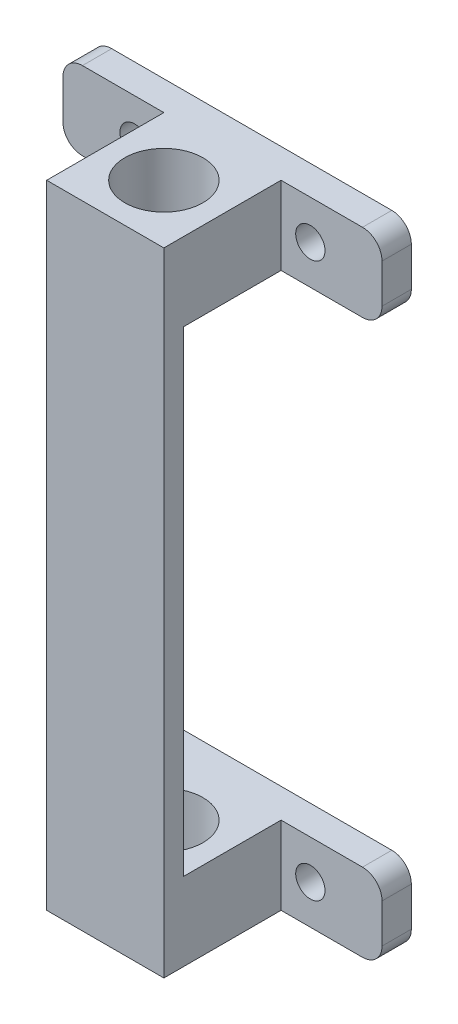
ISO-10303-21;
HEADER;
FILE_DESCRIPTION(('STEP AP214'),'2;1');
FILE_NAME('part.step','',(''),(''),'','','');
FILE_SCHEMA(('AUTOMOTIVE_DESIGN { 1 0 10303 214 1 1 1 1 }'));
ENDSEC;
DATA;
#1=APPLICATION_CONTEXT('core data for automotive mechanical design processes');
#2=APPLICATION_PROTOCOL_DEFINITION('international standard','automotive_design',2000,#1);
#3=PRODUCT_CONTEXT('',#1,'mechanical');
#4=PRODUCT('Part','Part','',(#3));
#5=PRODUCT_RELATED_PRODUCT_CATEGORY('part','',(#4));
#6=PRODUCT_DEFINITION_FORMATION('','',#4);
#7=PRODUCT_DEFINITION_CONTEXT('part definition',#1,'design');
#8=PRODUCT_DEFINITION('design','',#6,#7);
#9=PRODUCT_DEFINITION_SHAPE('','',#8);
#10=(LENGTH_UNIT() NAMED_UNIT(*) SI_UNIT(.MILLI.,.METRE.));
#11=(NAMED_UNIT(*) PLANE_ANGLE_UNIT() SI_UNIT($,.RADIAN.));
#12=(NAMED_UNIT(*) SI_UNIT($,.STERADIAN.) SOLID_ANGLE_UNIT());
#13=UNCERTAINTY_MEASURE_WITH_UNIT(LENGTH_MEASURE(1.E-05),#10,'distance_accuracy_value','');
#14=(GEOMETRIC_REPRESENTATION_CONTEXT(3) GLOBAL_UNCERTAINTY_ASSIGNED_CONTEXT((#13)) GLOBAL_UNIT_ASSIGNED_CONTEXT((#10,
#11,#12)) REPRESENTATION_CONTEXT('',''));
#15=CARTESIAN_POINT('',(0.,0.,0.));
#16=DIRECTION('',(0.,0.,1.));
#17=DIRECTION('',(1.,0.,0.));
#18=AXIS2_PLACEMENT_3D('',#15,#16,#17);
#19=CARTESIAN_POINT('',(-20.0653915042754,22.358574689139,-3.));
#20=DIRECTION('',(0.,-1.,0.));
#21=DIRECTION('',(0.,0.,-1.));
#22=AXIS2_PLACEMENT_3D('',#19,#20,#21);
#23=PLANE('',#22);
#24=DIRECTION('',(1.,0.,0.));
#25=VECTOR('',#24,1.);
#26=CARTESIAN_POINT('',(-20.0653915042754,22.358574689139,-3.));
#27=LINE('',#26,#25);
#28=CARTESIAN_POINT('',(-18.0653915042754,22.358574689139,-3.));
#29=VERTEX_POINT('',#28);
#30=CARTESIAN_POINT('',(10.6119967977161,22.358574689139,-3.));
#31=VERTEX_POINT('',#30);
#32=EDGE_CURVE('E416',#29,#31,#27,.T.);
#33=ORIENTED_EDGE('',*,*,#32,.T.);
#34=DIRECTION('',(0.,0.,1.));
#35=VECTOR('',#34,1.);
#36=CARTESIAN_POINT('',(10.6119967977161,22.358574689139,-3.));
#37=LINE('',#36,#35);
#38=CARTESIAN_POINT('',(10.6119967977161,22.358574689139,0.));
#39=VERTEX_POINT('',#38);
#40=EDGE_CURVE('E430',#31,#39,#37,.T.);
#41=ORIENTED_EDGE('',*,*,#40,.T.);
#42=DIRECTION('',(1.,0.,0.));
#43=VECTOR('',#42,1.);
#44=CARTESIAN_POINT('',(-20.0653915042754,22.358574689139,0.));
#45=LINE('',#44,#43);
#46=CARTESIAN_POINT('',(2.27330264672038,22.358574689139,0.));
#47=VERTEX_POINT('',#46);
#48=EDGE_CURVE('E427',#47,#39,#45,.T.);
#49=ORIENTED_EDGE('',*,*,#48,.F.);
#50=DIRECTION('',(0.,0.,-1.));
#51=VECTOR('',#50,1.);
#52=CARTESIAN_POINT('',(2.27330264672038,22.358574689139,6.));
#53=LINE('',#52,#51);
#54=CARTESIAN_POINT('',(2.27330264672038,22.358574689139,10.));
#55=VERTEX_POINT('',#54);
#56=EDGE_CURVE('E386',#55,#47,#53,.T.);
#57=ORIENTED_EDGE('',*,*,#56,.F.);
#58=DIRECTION('',(-1.,0.,0.));
#59=VECTOR('',#58,1.);
#60=CARTESIAN_POINT('',(-9.72669735327963,22.358574689139,10.));
#61=LINE('',#60,#59);
#62=CARTESIAN_POINT('',(-3.72669735327962,22.358574689139,10.));
#63=VERTEX_POINT('',#62);
#64=EDGE_CURVE('E243',#55,#63,#61,.T.);
#65=ORIENTED_EDGE('',*,*,#64,.T.);
#66=CARTESIAN_POINT('',(-3.72669735327962,22.358574689139,6.));
#67=DIRECTION('',(0.,-1.,0.));
#68=DIRECTION('',(0.,0.,-1.));
#69=AXIS2_PLACEMENT_3D('',#66,#67,#68);
#70=CIRCLE('',#69,4.);
#71=EDGE_CURVE('E362',#63,#63,#70,.T.);
#72=ORIENTED_EDGE('',*,*,#71,.F.);
#73=CARTESIAN_POINT('',(-9.72669735327963,22.358574689139,10.));
#74=VERTEX_POINT('',#73);
#75=EDGE_CURVE('E246',#63,#74,#61,.T.);
#76=ORIENTED_EDGE('',*,*,#75,.T.);
#77=DIRECTION('',(0.,0.,-1.));
#78=VECTOR('',#77,1.);
#79=CARTESIAN_POINT('',(-9.72669735327963,22.358574689139,6.));
#80=LINE('',#79,#78);
#81=CARTESIAN_POINT('',(-9.72669735327963,22.358574689139,0.));
#82=VERTEX_POINT('',#81);
#83=EDGE_CURVE('E382',#74,#82,#80,.T.);
#84=ORIENTED_EDGE('',*,*,#83,.T.);
#85=CARTESIAN_POINT('',(-18.0653915042754,22.358574689139,0.));
#86=VERTEX_POINT('',#85);
#87=EDGE_CURVE('E410',#86,#82,#45,.T.);
#88=ORIENTED_EDGE('',*,*,#87,.F.);
#89=DIRECTION('',(0.,0.,1.));
#90=VECTOR('',#89,1.);
#91=CARTESIAN_POINT('',(-18.0653915042754,22.358574689139,-3.));
#92=LINE('',#91,#90);
#93=EDGE_CURVE('E419',#86,#29,#92,.F.);
#94=ORIENTED_EDGE('',*,*,#93,.T.);
#95=EDGE_LOOP('',(#33,#41,#49,#57,#65,#72,#76,#84,#88,#94));
#96=FACE_BOUND('',#95,.T.);
#97=ADVANCED_FACE('F69',(#96),#23,.T.);
#98=CARTESIAN_POINT('',(0.,0.,0.));
#99=DIRECTION('',(0.,0.,1.));
#100=DIRECTION('',(1.,0.,0.));
#101=AXIS2_PLACEMENT_3D('',#98,#99,#100);
#102=PLANE('',#101);
#103=CARTESIAN_POINT('',(5.27330264672038,26.358574689139,0.));
#104=DIRECTION('',(0.,0.,1.));
#105=DIRECTION('',(1.,0.,0.));
#106=AXIS2_PLACEMENT_3D('',#103,#104,#105);
#107=CIRCLE('',#106,1.5);
#108=CARTESIAN_POINT('',(6.77330264672038,26.358574689139,0.));
#109=VERTEX_POINT('',#108);
#110=EDGE_CURVE('E391',#109,#109,#107,.T.);
#111=ORIENTED_EDGE('',*,*,#110,.F.);
#112=EDGE_LOOP('',(#111));
#113=FACE_BOUND('',#112,.T.);
#114=ORIENTED_EDGE('',*,*,#48,.T.);
#115=CARTESIAN_POINT('',(10.6119967977161,24.358574689139,0.));
#116=DIRECTION('',(0.,0.,1.));
#117=DIRECTION('',(1.,0.,0.));
#118=AXIS2_PLACEMENT_3D('',#115,#116,#117);
#119=CIRCLE('',#118,2.);
#120=CARTESIAN_POINT('',(12.6119967977161,24.358574689139,0.));
#121=VERTEX_POINT('',#120);
#122=EDGE_CURVE('E435',#39,#121,#119,.T.);
#123=ORIENTED_EDGE('',*,*,#122,.T.);
#124=DIRECTION('',(0.,1.,0.));
#125=VECTOR('',#124,1.);
#126=CARTESIAN_POINT('',(12.6119967977161,30.358574689139,0.));
#127=LINE('',#126,#125);
#128=CARTESIAN_POINT('',(12.6119967977161,28.358574689139,0.));
#129=VERTEX_POINT('',#128);
#130=EDGE_CURVE('E397',#121,#129,#127,.T.);
#131=ORIENTED_EDGE('',*,*,#130,.T.);
#132=CARTESIAN_POINT('',(10.6119967977161,28.358574689139,0.));
#133=DIRECTION('',(0.,0.,1.));
#134=DIRECTION('',(1.,0.,0.));
#135=AXIS2_PLACEMENT_3D('',#132,#133,#134);
#136=CIRCLE('',#135,2.);
#137=CARTESIAN_POINT('',(10.6119967977161,30.358574689139,0.));
#138=VERTEX_POINT('',#137);
#139=EDGE_CURVE('E433',#129,#138,#136,.T.);
#140=ORIENTED_EDGE('',*,*,#139,.T.);
#141=DIRECTION('',(-1.,0.,0.));
#142=VECTOR('',#141,1.);
#143=CARTESIAN_POINT('',(-20.0653915042754,30.358574689139,0.));
#144=LINE('',#143,#142);
#145=CARTESIAN_POINT('',(2.27330264672038,30.358574689139,0.));
#146=VERTEX_POINT('',#145);
#147=EDGE_CURVE('E423',#138,#146,#144,.T.);
#148=ORIENTED_EDGE('',*,*,#147,.T.);
#149=DIRECTION('',(0.,-1.,0.));
#150=VECTOR('',#149,1.);
#151=CARTESIAN_POINT('',(2.27330264672038,38.8438560633776,0.));
#152=LINE('',#151,#150);
#153=EDGE_CURVE('E385',#146,#47,#152,.T.);
#154=ORIENTED_EDGE('',*,*,#153,.T.);
#155=EDGE_LOOP('',(#114,#123,#131,#140,#148,#154));
#156=FACE_BOUND('',#155,.T.);
#157=ADVANCED_FACE('F483',(#113,#156),#102,.T.);
#158=CARTESIAN_POINT('',(12.6119967977161,30.358574689139,-3.));
#159=DIRECTION('',(1.,0.,0.));
#160=DIRECTION('',(0.,1.,0.));
#161=AXIS2_PLACEMENT_3D('',#158,#159,#160);
#162=PLANE('',#161);
#163=ORIENTED_EDGE('',*,*,#130,.F.);
#164=DIRECTION('',(0.,0.,1.));
#165=VECTOR('',#164,1.);
#166=CARTESIAN_POINT('',(12.6119967977161,24.358574689139,-3.));
#167=LINE('',#166,#165);
#168=CARTESIAN_POINT('',(12.6119967977161,24.358574689139,-3.));
#169=VERTEX_POINT('',#168);
#170=EDGE_CURVE('E440',#121,#169,#167,.F.);
#171=ORIENTED_EDGE('',*,*,#170,.T.);
#172=DIRECTION('',(0.,1.,0.));
#173=VECTOR('',#172,1.);
#174=CARTESIAN_POINT('',(12.6119967977161,30.358574689139,-3.));
#175=LINE('',#174,#173);
#176=CARTESIAN_POINT('',(12.6119967977161,28.358574689139,-3.));
#177=VERTEX_POINT('',#176);
#178=EDGE_CURVE('E406',#169,#177,#175,.T.);
#179=ORIENTED_EDGE('',*,*,#178,.T.);
#180=DIRECTION('',(0.,0.,1.));
#181=VECTOR('',#180,1.);
#182=CARTESIAN_POINT('',(12.6119967977161,28.358574689139,-3.));
#183=LINE('',#182,#181);
#184=EDGE_CURVE('E437',#177,#129,#183,.T.);
#185=ORIENTED_EDGE('',*,*,#184,.T.);
#186=EDGE_LOOP('',(#163,#171,#179,#185));
#187=FACE_BOUND('',#186,.T.);
#188=ADVANCED_FACE('F485',(#187),#162,.T.);
#189=CARTESIAN_POINT('',(-20.0653915042754,30.358574689139,-3.));
#190=DIRECTION('',(-1.,0.,0.));
#191=DIRECTION('',(0.,0.,1.));
#192=AXIS2_PLACEMENT_3D('',#189,#190,#191);
#193=PLANE('',#192);
#194=DIRECTION('',(0.,-1.,0.));
#195=VECTOR('',#194,1.);
#196=CARTESIAN_POINT('',(-20.0653915042754,30.358574689139,-3.));
#197=LINE('',#196,#195);
#198=CARTESIAN_POINT('',(-20.0653915042754,28.358574689139,-3.));
#199=VERTEX_POINT('',#198);
#200=CARTESIAN_POINT('',(-20.0653915042754,24.358574689139,-3.));
#201=VERTEX_POINT('',#200);
#202=EDGE_CURVE('E413',#199,#201,#197,.T.);
#203=ORIENTED_EDGE('',*,*,#202,.T.);
#204=DIRECTION('',(0.,0.,1.));
#205=VECTOR('',#204,1.);
#206=CARTESIAN_POINT('',(-20.0653915042754,24.358574689139,-3.));
#207=LINE('',#206,#205);
#208=CARTESIAN_POINT('',(-20.0653915042754,24.358574689139,0.));
#209=VERTEX_POINT('',#208);
#210=EDGE_CURVE('E457',#201,#209,#207,.T.);
#211=ORIENTED_EDGE('',*,*,#210,.T.);
#212=DIRECTION('',(0.,-1.,0.));
#213=VECTOR('',#212,1.);
#214=CARTESIAN_POINT('',(-20.0653915042754,30.358574689139,0.));
#215=LINE('',#214,#213);
#216=CARTESIAN_POINT('',(-20.0653915042754,28.358574689139,0.));
#217=VERTEX_POINT('',#216);
#218=EDGE_CURVE('E425',#217,#209,#215,.T.);
#219=ORIENTED_EDGE('',*,*,#218,.F.);
#220=DIRECTION('',(0.,0.,1.));
#221=VECTOR('',#220,1.);
#222=CARTESIAN_POINT('',(-20.0653915042754,28.358574689139,-3.));
#223=LINE('',#222,#221);
#224=EDGE_CURVE('E455',#217,#199,#223,.F.);
#225=ORIENTED_EDGE('',*,*,#224,.T.);
#226=EDGE_LOOP('',(#203,#211,#219,#225));
#227=FACE_BOUND('',#226,.T.);
#228=ADVANCED_FACE('F459',(#227),#193,.T.);
#229=CARTESIAN_POINT('',(-20.0653915042754,30.358574689139,-3.));
#230=DIRECTION('',(0.,1.,0.));
#231=DIRECTION('',(-1.,0.,0.));
#232=AXIS2_PLACEMENT_3D('',#229,#230,#231);
#233=PLANE('',#232);
#234=CARTESIAN_POINT('',(-3.72669735327962,30.358574689139,6.));
#235=DIRECTION('',(0.,-1.,0.));
#236=DIRECTION('',(0.,0.,-1.));
#237=AXIS2_PLACEMENT_3D('',#234,#235,#236);
#238=CIRCLE('',#237,4.);
#239=CARTESIAN_POINT('',(-3.72669735327962,30.358574689139,2.));
#240=VERTEX_POINT('',#239);
#241=EDGE_CURVE('E247',#240,#240,#238,.T.);
#242=ORIENTED_EDGE('',*,*,#241,.T.);
#243=EDGE_LOOP('',(#242));
#244=FACE_BOUND('',#243,.T.);
#245=ORIENTED_EDGE('',*,*,#147,.F.);
#246=DIRECTION('',(0.,0.,1.));
#247=VECTOR('',#246,1.);
#248=CARTESIAN_POINT('',(10.6119967977161,30.358574689139,-3.));
#249=LINE('',#248,#247);
#250=CARTESIAN_POINT('',(10.6119967977161,30.358574689139,-3.));
#251=VERTEX_POINT('',#250);
#252=EDGE_CURVE('E453',#138,#251,#249,.F.);
#253=ORIENTED_EDGE('',*,*,#252,.T.);
#254=DIRECTION('',(-1.,0.,0.));
#255=VECTOR('',#254,1.);
#256=CARTESIAN_POINT('',(-20.0653915042754,30.358574689139,-3.));
#257=LINE('',#256,#255);
#258=CARTESIAN_POINT('',(-18.0653915042754,30.358574689139,-3.));
#259=VERTEX_POINT('',#258);
#260=EDGE_CURVE('E409',#251,#259,#257,.T.);
#261=ORIENTED_EDGE('',*,*,#260,.T.);
#262=DIRECTION('',(0.,0.,1.));
#263=VECTOR('',#262,1.);
#264=CARTESIAN_POINT('',(-18.0653915042754,30.358574689139,-3.));
#265=LINE('',#264,#263);
#266=CARTESIAN_POINT('',(-18.0653915042754,30.358574689139,0.));
#267=VERTEX_POINT('',#266);
#268=EDGE_CURVE('E450',#259,#267,#265,.T.);
#269=ORIENTED_EDGE('',*,*,#268,.T.);
#270=CARTESIAN_POINT('',(-9.72669735327963,30.358574689139,0.));
#271=VERTEX_POINT('',#270);
#272=EDGE_CURVE('E422',#271,#267,#144,.T.);
#273=ORIENTED_EDGE('',*,*,#272,.F.);
#274=DIRECTION('',(0.,0.,-1.));
#275=VECTOR('',#274,1.);
#276=CARTESIAN_POINT('',(-9.72669735327963,30.358574689139,6.));
#277=LINE('',#276,#275);
#278=CARTESIAN_POINT('',(-9.72669735327963,30.358574689139,12.));
#279=VERTEX_POINT('',#278);
#280=EDGE_CURVE('E379',#279,#271,#277,.T.);
#281=ORIENTED_EDGE('',*,*,#280,.F.);
#282=DIRECTION('',(1.,0.,0.));
#283=VECTOR('',#282,1.);
#284=CARTESIAN_POINT('',(-9.72669735327962,30.358574689139,12.));
#285=LINE('',#284,#283);
#286=CARTESIAN_POINT('',(2.27330264672038,30.358574689139,12.));
#287=VERTEX_POINT('',#286);
#288=EDGE_CURVE('E372',#279,#287,#285,.T.);
#289=ORIENTED_EDGE('',*,*,#288,.T.);
#290=DIRECTION('',(0.,0.,-1.));
#291=VECTOR('',#290,1.);
#292=CARTESIAN_POINT('',(2.27330264672038,30.358574689139,6.));
#293=LINE('',#292,#291);
#294=EDGE_CURVE('E388',#287,#146,#293,.T.);
#295=ORIENTED_EDGE('',*,*,#294,.T.);
#296=EDGE_LOOP('',(#245,#253,#261,#269,#273,#281,#289,#295));
#297=FACE_BOUND('',#296,.T.);
#298=ADVANCED_FACE('F494',(#244,#297),#233,.T.);
#299=CARTESIAN_POINT('',(0.,0.,-3.));
#300=DIRECTION('',(0.,0.,1.));
#301=DIRECTION('',(1.,0.,0.));
#302=AXIS2_PLACEMENT_3D('',#299,#300,#301);
#303=PLANE('',#302);
#304=CARTESIAN_POINT('',(-12.7266973532796,26.358574689139,-3.));
#305=DIRECTION('',(0.,0.,1.));
#306=DIRECTION('',(1.,0.,0.));
#307=AXIS2_PLACEMENT_3D('',#304,#305,#306);
#308=CIRCLE('',#307,1.5);
#309=CARTESIAN_POINT('',(-11.2266973532796,26.358574689139,-3.));
#310=VERTEX_POINT('',#309);
#311=EDGE_CURVE('E394',#310,#310,#308,.T.);
#312=ORIENTED_EDGE('',*,*,#311,.T.);
#313=EDGE_LOOP('',(#312));
#314=FACE_BOUND('',#313,.T.);
#315=CARTESIAN_POINT('',(5.27330264672038,26.358574689139,-3.));
#316=DIRECTION('',(0.,0.,1.));
#317=DIRECTION('',(1.,0.,0.));
#318=AXIS2_PLACEMENT_3D('',#315,#316,#317);
#319=CIRCLE('',#318,1.5);
#320=CARTESIAN_POINT('',(6.77330264672038,26.358574689139,-3.));
#321=VERTEX_POINT('',#320);
#322=EDGE_CURVE('E401',#321,#321,#319,.T.);
#323=ORIENTED_EDGE('',*,*,#322,.T.);
#324=EDGE_LOOP('',(#323));
#325=FACE_BOUND('',#324,.T.);
#326=ORIENTED_EDGE('',*,*,#178,.F.);
#327=CARTESIAN_POINT('',(10.6119967977161,24.358574689139,-3.));
#328=DIRECTION('',(0.,0.,1.));
#329=DIRECTION('',(1.,0.,0.));
#330=AXIS2_PLACEMENT_3D('',#327,#328,#329);
#331=CIRCLE('',#330,2.);
#332=EDGE_CURVE('E448',#169,#31,#331,.F.);
#333=ORIENTED_EDGE('',*,*,#332,.T.);
#334=ORIENTED_EDGE('',*,*,#32,.F.);
#335=CARTESIAN_POINT('',(-18.0653915042754,24.358574689139,-3.));
#336=DIRECTION('',(0.,0.,1.));
#337=DIRECTION('',(1.,0.,0.));
#338=AXIS2_PLACEMENT_3D('',#335,#336,#337);
#339=CIRCLE('',#338,2.);
#340=EDGE_CURVE('E444',#29,#201,#339,.F.);
#341=ORIENTED_EDGE('',*,*,#340,.T.);
#342=ORIENTED_EDGE('',*,*,#202,.F.);
#343=CARTESIAN_POINT('',(-18.0653915042754,28.358574689139,-3.));
#344=DIRECTION('',(0.,0.,1.));
#345=DIRECTION('',(1.,0.,0.));
#346=AXIS2_PLACEMENT_3D('',#343,#344,#345);
#347=CIRCLE('',#346,2.);
#348=EDGE_CURVE('E442',#199,#259,#347,.F.);
#349=ORIENTED_EDGE('',*,*,#348,.T.);
#350=ORIENTED_EDGE('',*,*,#260,.F.);
#351=CARTESIAN_POINT('',(10.6119967977161,28.358574689139,-3.));
#352=DIRECTION('',(0.,0.,1.));
#353=DIRECTION('',(1.,0.,0.));
#354=AXIS2_PLACEMENT_3D('',#351,#352,#353);
#355=CIRCLE('',#354,2.);
#356=EDGE_CURVE('E446',#251,#177,#355,.F.);
#357=ORIENTED_EDGE('',*,*,#356,.T.);
#358=EDGE_LOOP('',(#326,#333,#334,#341,#342,#349,#350,#357));
#359=FACE_BOUND('',#358,.T.);
#360=ADVANCED_FACE('F472',(#314,#325,#359),#303,.F.);
#361=ORIENTED_EDGE('',*,*,#218,.T.);
#362=CARTESIAN_POINT('',(-18.0653915042754,24.358574689139,0.));
#363=DIRECTION('',(0.,0.,1.));
#364=DIRECTION('',(1.,0.,0.));
#365=AXIS2_PLACEMENT_3D('',#362,#363,#364);
#366=CIRCLE('',#365,2.);
#367=EDGE_CURVE('E12',#209,#86,#366,.T.);
#368=ORIENTED_EDGE('',*,*,#367,.T.);
#369=ORIENTED_EDGE('',*,*,#87,.T.);
#370=DIRECTION('',(0.,-1.,0.));
#371=VECTOR('',#370,1.);
#372=CARTESIAN_POINT('',(-9.72669735327963,38.8438560633776,0.));
#373=LINE('',#372,#371);
#374=EDGE_CURVE('E375',#271,#82,#373,.T.);
#375=ORIENTED_EDGE('',*,*,#374,.F.);
#376=ORIENTED_EDGE('',*,*,#272,.T.);
#377=CARTESIAN_POINT('',(-18.0653915042754,28.358574689139,0.));
#378=DIRECTION('',(0.,0.,1.));
#379=DIRECTION('',(1.,0.,0.));
#380=AXIS2_PLACEMENT_3D('',#377,#378,#379);
#381=CIRCLE('',#380,2.);
#382=EDGE_CURVE('E77',#267,#217,#381,.T.);
#383=ORIENTED_EDGE('',*,*,#382,.T.);
#384=EDGE_LOOP('',(#361,#368,#369,#375,#376,#383));
#385=FACE_BOUND('',#384,.T.);
#386=CARTESIAN_POINT('',(-12.7266973532796,26.358574689139,0.));
#387=DIRECTION('',(0.,0.,1.));
#388=DIRECTION('',(1.,0.,0.));
#389=AXIS2_PLACEMENT_3D('',#386,#387,#388);
#390=CIRCLE('',#389,1.5);
#391=CARTESIAN_POINT('',(-11.2266973532796,26.358574689139,0.));
#392=VERTEX_POINT('',#391);
#393=EDGE_CURVE('E398',#392,#392,#390,.T.);
#394=ORIENTED_EDGE('',*,*,#393,.F.);
#395=EDGE_LOOP('',(#394));
#396=FACE_BOUND('',#395,.T.);
#397=ADVANCED_FACE('F463',(#385,#396),#102,.T.);
#398=CARTESIAN_POINT('',(5.27330264672038,26.358574689139,-3.));
#399=DIRECTION('',(0.,0.,1.));
#400=DIRECTION('',(1.,0.,0.));
#401=AXIS2_PLACEMENT_3D('',#398,#399,#400);
#402=CYLINDRICAL_SURFACE('',#401,1.5);
#403=ORIENTED_EDGE('',*,*,#322,.F.);
#404=EDGE_LOOP('',(#403));
#405=FACE_BOUND('',#404,.T.);
#406=ORIENTED_EDGE('',*,*,#110,.T.);
#407=EDGE_LOOP('',(#406));
#408=FACE_BOUND('',#407,.T.);
#409=ADVANCED_FACE('F735',(#405,#408),#402,.F.);
#410=CARTESIAN_POINT('',(-12.7266973532796,26.358574689139,-3.));
#411=DIRECTION('',(0.,0.,1.));
#412=DIRECTION('',(1.,0.,0.));
#413=AXIS2_PLACEMENT_3D('',#410,#411,#412);
#414=CYLINDRICAL_SURFACE('',#413,1.5);
#415=ORIENTED_EDGE('',*,*,#311,.F.);
#416=EDGE_LOOP('',(#415));
#417=FACE_BOUND('',#416,.T.);
#418=ORIENTED_EDGE('',*,*,#393,.T.);
#419=EDGE_LOOP('',(#418));
#420=FACE_BOUND('',#419,.T.);
#421=ADVANCED_FACE('F558',(#417,#420),#414,.F.);
#422=CARTESIAN_POINT('',(2.27330264672038,38.8438560633776,6.));
#423=DIRECTION('',(-1.,0.,0.));
#424=DIRECTION('',(0.,0.,1.));
#425=AXIS2_PLACEMENT_3D('',#422,#423,#424);
#426=PLANE('',#425);
#427=ORIENTED_EDGE('',*,*,#294,.F.);
#428=DIRECTION('',(0.,-1.,0.));
#429=VECTOR('',#428,1.);
#430=CARTESIAN_POINT('',(2.27330264672038,38.8438560633776,12.));
#431=LINE('',#430,#429);
#432=CARTESIAN_POINT('',(2.27330264672038,-34.381425310861,12.));
#433=VERTEX_POINT('',#432);
#434=EDGE_CURVE('E369',#287,#433,#431,.T.);
#435=ORIENTED_EDGE('',*,*,#434,.T.);
#436=DIRECTION('',(0.,0.,-1.));
#437=VECTOR('',#436,1.);
#438=CARTESIAN_POINT('',(2.27330264672038,-34.381425310861,6.));
#439=LINE('',#438,#437);
#440=CARTESIAN_POINT('',(2.27330264672038,-34.381425310861,0.));
#441=VERTEX_POINT('',#440);
#442=EDGE_CURVE('E257',#433,#441,#439,.T.);
#443=ORIENTED_EDGE('',*,*,#442,.T.);
#444=DIRECTION('',(0.,1.,0.));
#445=VECTOR('',#444,1.);
#446=CARTESIAN_POINT('',(2.27330264672038,-42.8667066850995,0.));
#447=LINE('',#446,#445);
#448=CARTESIAN_POINT('',(2.27330264672038,-26.381425310861,0.));
#449=VERTEX_POINT('',#448);
#450=EDGE_CURVE('E253',#441,#449,#447,.T.);
#451=ORIENTED_EDGE('',*,*,#450,.T.);
#452=DIRECTION('',(0.,0.,-1.));
#453=VECTOR('',#452,1.);
#454=CARTESIAN_POINT('',(2.27330264672038,-26.381425310861,6.));
#455=LINE('',#454,#453);
#456=CARTESIAN_POINT('',(2.27330264672038,-26.381425310861,10.));
#457=VERTEX_POINT('',#456);
#458=EDGE_CURVE('E250',#457,#449,#455,.T.);
#459=ORIENTED_EDGE('',*,*,#458,.F.);
#460=DIRECTION('',(0.,1.,0.));
#461=VECTOR('',#460,1.);
#462=CARTESIAN_POINT('',(2.27330264672038,22.358574689139,10.));
#463=LINE('',#462,#461);
#464=EDGE_CURVE('E234',#457,#55,#463,.T.);
#465=ORIENTED_EDGE('',*,*,#464,.T.);
#466=ORIENTED_EDGE('',*,*,#56,.T.);
#467=ORIENTED_EDGE('',*,*,#153,.F.);
#468=EDGE_LOOP('',(#427,#435,#443,#451,#459,#465,#466,#467));
#469=FACE_BOUND('',#468,.T.);
#470=ADVANCED_FACE('F251',(#469),#426,.F.);
#471=CARTESIAN_POINT('',(-9.72669735327963,38.8438560633776,6.));
#472=DIRECTION('',(-1.,0.,0.));
#473=DIRECTION('',(0.,0.,1.));
#474=AXIS2_PLACEMENT_3D('',#471,#472,#473);
#475=PLANE('',#474);
#476=ORIENTED_EDGE('',*,*,#83,.F.);
#477=DIRECTION('',(0.,-1.,0.));
#478=VECTOR('',#477,1.);
#479=CARTESIAN_POINT('',(-9.72669735327963,22.358574689139,10.));
#480=LINE('',#479,#478);
#481=CARTESIAN_POINT('',(-9.72669735327963,-26.381425310861,10.));
#482=VERTEX_POINT('',#481);
#483=EDGE_CURVE('E367',#74,#482,#480,.T.);
#484=ORIENTED_EDGE('',*,*,#483,.T.);
#485=DIRECTION('',(0.,0.,-1.));
#486=VECTOR('',#485,1.);
#487=CARTESIAN_POINT('',(-9.72669735327963,-26.381425310861,6.));
#488=LINE('',#487,#486);
#489=CARTESIAN_POINT('',(-9.72669735327963,-26.381425310861,0.));
#490=VERTEX_POINT('',#489);
#491=EDGE_CURVE('E278',#482,#490,#488,.T.);
#492=ORIENTED_EDGE('',*,*,#491,.T.);
#493=DIRECTION('',(0.,1.,0.));
#494=VECTOR('',#493,1.);
#495=CARTESIAN_POINT('',(-9.72669735327963,-42.8667066850995,0.));
#496=LINE('',#495,#494);
#497=CARTESIAN_POINT('',(-9.72669735327963,-34.381425310861,0.));
#498=VERTEX_POINT('',#497);
#499=EDGE_CURVE('E268',#498,#490,#496,.T.);
#500=ORIENTED_EDGE('',*,*,#499,.F.);
#501=DIRECTION('',(0.,0.,-1.));
#502=VECTOR('',#501,1.);
#503=CARTESIAN_POINT('',(-9.72669735327963,-34.3814253108609,6.));
#504=LINE('',#503,#502);
#505=CARTESIAN_POINT('',(-9.72669735327963,-34.3814253108609,12.));
#506=VERTEX_POINT('',#505);
#507=EDGE_CURVE('E275',#506,#498,#504,.T.);
#508=ORIENTED_EDGE('',*,*,#507,.F.);
#509=DIRECTION('',(0.,-1.,0.));
#510=VECTOR('',#509,1.);
#511=CARTESIAN_POINT('',(-9.72669735327963,38.8438560633776,12.));
#512=LINE('',#511,#510);
#513=EDGE_CURVE('E371',#279,#506,#512,.T.);
#514=ORIENTED_EDGE('',*,*,#513,.F.);
#515=ORIENTED_EDGE('',*,*,#280,.T.);
#516=ORIENTED_EDGE('',*,*,#374,.T.);
#517=EDGE_LOOP('',(#476,#484,#492,#500,#508,#514,#515,#516));
#518=FACE_BOUND('',#517,.T.);
#519=ADVANCED_FACE('F503',(#518),#475,.T.);
#520=CARTESIAN_POINT('',(-9.72669735327963,38.8438560633776,12.));
#521=DIRECTION('',(0.,0.,-1.));
#522=DIRECTION('',(-1.,0.,0.));
#523=AXIS2_PLACEMENT_3D('',#520,#521,#522);
#524=PLANE('',#523);
#525=ORIENTED_EDGE('',*,*,#288,.F.);
#526=ORIENTED_EDGE('',*,*,#513,.T.);
#527=DIRECTION('',(1.,0.,0.));
#528=VECTOR('',#527,1.);
#529=CARTESIAN_POINT('',(-9.72669735327962,-34.3814253108609,12.));
#530=LINE('',#529,#528);
#531=EDGE_CURVE('E264',#506,#433,#530,.T.);
#532=ORIENTED_EDGE('',*,*,#531,.T.);
#533=ORIENTED_EDGE('',*,*,#434,.F.);
#534=EDGE_LOOP('',(#525,#526,#532,#533));
#535=FACE_BOUND('',#534,.T.);
#536=ADVANCED_FACE('F570',(#535),#524,.F.);
#537=CARTESIAN_POINT('',(0.,0.,10.));
#538=DIRECTION('',(0.,0.,1.));
#539=DIRECTION('',(1.,0.,0.));
#540=AXIS2_PLACEMENT_3D('',#537,#538,#539);
#541=PLANE('',#540);
#542=ORIENTED_EDGE('',*,*,#464,.F.);
#543=DIRECTION('',(-1.,0.,0.));
#544=VECTOR('',#543,1.);
#545=CARTESIAN_POINT('',(-9.72669735327963,-26.381425310861,10.));
#546=LINE('',#545,#544);
#547=CARTESIAN_POINT('',(-3.72669735327962,-26.381425310861,10.));
#548=VERTEX_POINT('',#547);
#549=EDGE_CURVE('E239',#457,#548,#546,.T.);
#550=ORIENTED_EDGE('',*,*,#549,.T.);
#551=EDGE_CURVE('E265',#548,#482,#546,.T.);
#552=ORIENTED_EDGE('',*,*,#551,.T.);
#553=ORIENTED_EDGE('',*,*,#483,.F.);
#554=ORIENTED_EDGE('',*,*,#75,.F.);
#555=ORIENTED_EDGE('',*,*,#64,.F.);
#556=EDGE_LOOP('',(#542,#550,#552,#553,#554,#555));
#557=FACE_BOUND('',#556,.T.);
#558=ADVANCED_FACE('F236',(#557),#541,.F.);
#559=CARTESIAN_POINT('',(-3.72669735327962,30.358574689139,6.));
#560=DIRECTION('',(0.,-1.,0.));
#561=DIRECTION('',(0.,0.,-1.));
#562=AXIS2_PLACEMENT_3D('',#559,#560,#561);
#563=CYLINDRICAL_SURFACE('',#562,4.);
#564=ORIENTED_EDGE('',*,*,#241,.F.);
#565=EDGE_LOOP('',(#564));
#566=FACE_BOUND('',#565,.T.);
#567=ORIENTED_EDGE('',*,*,#71,.T.);
#568=EDGE_LOOP('',(#567));
#569=FACE_BOUND('',#568,.T.);
#570=ADVANCED_FACE('F533',(#566,#569),#563,.F.);
#571=CARTESIAN_POINT('',(10.6119967977161,24.358574689139,-3.));
#572=DIRECTION('',(0.,0.,1.));
#573=DIRECTION('',(1.,0.,0.));
#574=AXIS2_PLACEMENT_3D('',#571,#572,#573);
#575=CYLINDRICAL_SURFACE('',#574,2.);
#576=ORIENTED_EDGE('',*,*,#332,.F.);
#577=ORIENTED_EDGE('',*,*,#170,.F.);
#578=ORIENTED_EDGE('',*,*,#122,.F.);
#579=ORIENTED_EDGE('',*,*,#40,.F.);
#580=EDGE_LOOP('',(#576,#577,#578,#579));
#581=FACE_BOUND('',#580,.T.);
#582=ADVANCED_FACE('F479',(#581),#575,.T.);
#583=CARTESIAN_POINT('',(10.6119967977161,28.358574689139,-3.));
#584=DIRECTION('',(0.,0.,1.));
#585=DIRECTION('',(1.,0.,0.));
#586=AXIS2_PLACEMENT_3D('',#583,#584,#585);
#587=CYLINDRICAL_SURFACE('',#586,2.);
#588=ORIENTED_EDGE('',*,*,#356,.F.);
#589=ORIENTED_EDGE('',*,*,#252,.F.);
#590=ORIENTED_EDGE('',*,*,#139,.F.);
#591=ORIENTED_EDGE('',*,*,#184,.F.);
#592=EDGE_LOOP('',(#588,#589,#590,#591));
#593=FACE_BOUND('',#592,.T.);
#594=ADVANCED_FACE('F489',(#593),#587,.T.);
#595=CARTESIAN_POINT('',(-18.0653915042754,24.358574689139,-3.));
#596=DIRECTION('',(0.,0.,1.));
#597=DIRECTION('',(1.,0.,0.));
#598=AXIS2_PLACEMENT_3D('',#595,#596,#597);
#599=CYLINDRICAL_SURFACE('',#598,2.);
#600=ORIENTED_EDGE('',*,*,#340,.F.);
#601=ORIENTED_EDGE('',*,*,#93,.F.);
#602=ORIENTED_EDGE('',*,*,#367,.F.);
#603=ORIENTED_EDGE('',*,*,#210,.F.);
#604=EDGE_LOOP('',(#600,#601,#602,#603));
#605=FACE_BOUND('',#604,.T.);
#606=ADVANCED_FACE('F469',(#605),#599,.T.);
#607=CARTESIAN_POINT('',(-18.0653915042754,28.358574689139,-3.));
#608=DIRECTION('',(0.,0.,1.));
#609=DIRECTION('',(1.,0.,0.));
#610=AXIS2_PLACEMENT_3D('',#607,#608,#609);
#611=CYLINDRICAL_SURFACE('',#610,2.);
#612=ORIENTED_EDGE('',*,*,#348,.F.);
#613=ORIENTED_EDGE('',*,*,#224,.F.);
#614=ORIENTED_EDGE('',*,*,#382,.F.);
#615=ORIENTED_EDGE('',*,*,#268,.F.);
#616=EDGE_LOOP('',(#612,#613,#614,#615));
#617=FACE_BOUND('',#616,.T.);
#618=ADVANCED_FACE('F71',(#617),#611,.T.);
#619=CARTESIAN_POINT('',(-20.0653915042754,-26.381425310861,-3.));
#620=DIRECTION('',(0.,1.,0.));
#621=DIRECTION('',(0.,0.,-1.));
#622=AXIS2_PLACEMENT_3D('',#619,#620,#621);
#623=PLANE('',#622);
#624=DIRECTION('',(1.,0.,0.));
#625=VECTOR('',#624,1.);
#626=CARTESIAN_POINT('',(-20.0653915042754,-26.381425310861,-3.));
#627=LINE('',#626,#625);
#628=CARTESIAN_POINT('',(-18.0653915042754,-26.381425310861,-3.));
#629=VERTEX_POINT('',#628);
#630=CARTESIAN_POINT('',(10.6119967977161,-26.381425310861,-3.));
#631=VERTEX_POINT('',#630);
#632=EDGE_CURVE('E306',#629,#631,#627,.T.);
#633=ORIENTED_EDGE('',*,*,#632,.F.);
#634=DIRECTION('',(0.,0.,1.));
#635=VECTOR('',#634,1.);
#636=CARTESIAN_POINT('',(-18.0653915042754,-26.381425310861,-3.));
#637=LINE('',#636,#635);
#638=CARTESIAN_POINT('',(-18.0653915042754,-26.381425310861,0.));
#639=VERTEX_POINT('',#638);
#640=EDGE_CURVE('E309',#639,#629,#637,.F.);
#641=ORIENTED_EDGE('',*,*,#640,.F.);
#642=DIRECTION('',(1.,0.,0.));
#643=VECTOR('',#642,1.);
#644=CARTESIAN_POINT('',(-20.0653915042754,-26.381425310861,0.));
#645=LINE('',#644,#643);
#646=EDGE_CURVE('E300',#639,#490,#645,.T.);
#647=ORIENTED_EDGE('',*,*,#646,.T.);
#648=ORIENTED_EDGE('',*,*,#491,.F.);
#649=ORIENTED_EDGE('',*,*,#551,.F.);
#650=CARTESIAN_POINT('',(-3.72669735327962,-26.381425310861,6.));
#651=DIRECTION('',(0.,-1.,0.));
#652=DIRECTION('',(0.,0.,-1.));
#653=AXIS2_PLACEMENT_3D('',#650,#651,#652);
#654=CIRCLE('',#653,4.);
#655=EDGE_CURVE('E263',#548,#548,#654,.T.);
#656=ORIENTED_EDGE('',*,*,#655,.T.);
#657=ORIENTED_EDGE('',*,*,#549,.F.);
#658=ORIENTED_EDGE('',*,*,#458,.T.);
#659=CARTESIAN_POINT('',(10.6119967977161,-26.381425310861,0.));
#660=VERTEX_POINT('',#659);
#661=EDGE_CURVE('E319',#449,#660,#645,.T.);
#662=ORIENTED_EDGE('',*,*,#661,.T.);
#663=DIRECTION('',(0.,0.,1.));
#664=VECTOR('',#663,1.);
#665=CARTESIAN_POINT('',(10.6119967977161,-26.381425310861,-3.));
#666=LINE('',#665,#664);
#667=EDGE_CURVE('E324',#631,#660,#666,.T.);
#668=ORIENTED_EDGE('',*,*,#667,.F.);
#669=EDGE_LOOP('',(#633,#641,#647,#648,#649,#656,#657,#658,#662,#668));
#670=FACE_BOUND('',#669,.T.);
#671=ADVANCED_FACE('F260',(#670),#623,.T.);
#672=CARTESIAN_POINT('',(0.,-4.02285062172191,0.));
#673=DIRECTION('',(0.,0.,1.));
#674=DIRECTION('',(1.,0.,0.));
#675=AXIS2_PLACEMENT_3D('',#672,#673,#674);
#676=PLANE('',#675);
#677=CARTESIAN_POINT('',(5.27330264672038,-30.381425310861,0.));
#678=DIRECTION('',(0.,0.,-1.));
#679=DIRECTION('',(1.,0.,0.));
#680=AXIS2_PLACEMENT_3D('',#677,#678,#679);
#681=CIRCLE('',#680,1.5);
#682=CARTESIAN_POINT('',(6.77330264672038,-30.381425310861,0.));
#683=VERTEX_POINT('',#682);
#684=EDGE_CURVE('E282',#683,#683,#681,.T.);
#685=ORIENTED_EDGE('',*,*,#684,.T.);
#686=EDGE_LOOP('',(#685));
#687=FACE_BOUND('',#686,.T.);
#688=ORIENTED_EDGE('',*,*,#661,.F.);
#689=ORIENTED_EDGE('',*,*,#450,.F.);
#690=DIRECTION('',(-1.,0.,0.));
#691=VECTOR('',#690,1.);
#692=CARTESIAN_POINT('',(-20.0653915042754,-34.3814253108609,0.));
#693=LINE('',#692,#691);
#694=CARTESIAN_POINT('',(10.6119967977161,-34.381425310861,0.));
#695=VERTEX_POINT('',#694);
#696=EDGE_CURVE('E313',#695,#441,#693,.T.);
#697=ORIENTED_EDGE('',*,*,#696,.F.);
#698=CARTESIAN_POINT('',(10.6119967977161,-32.381425310861,0.));
#699=DIRECTION('',(0.,0.,-1.));
#700=DIRECTION('',(1.,0.,0.));
#701=AXIS2_PLACEMENT_3D('',#698,#699,#700);
#702=CIRCLE('',#701,2.);
#703=CARTESIAN_POINT('',(12.6119967977161,-32.381425310861,0.));
#704=VERTEX_POINT('',#703);
#705=EDGE_CURVE('E327',#704,#695,#702,.T.);
#706=ORIENTED_EDGE('',*,*,#705,.F.);
#707=DIRECTION('',(0.,-1.,0.));
#708=VECTOR('',#707,1.);
#709=CARTESIAN_POINT('',(12.6119967977161,-34.381425310861,0.));
#710=LINE('',#709,#708);
#711=CARTESIAN_POINT('',(12.6119967977161,-28.381425310861,0.));
#712=VERTEX_POINT('',#711);
#713=EDGE_CURVE('E287',#712,#704,#710,.T.);
#714=ORIENTED_EDGE('',*,*,#713,.F.);
#715=CARTESIAN_POINT('',(10.6119967977161,-28.381425310861,0.));
#716=DIRECTION('',(0.,0.,-1.));
#717=DIRECTION('',(1.,0.,0.));
#718=AXIS2_PLACEMENT_3D('',#715,#716,#717);
#719=CIRCLE('',#718,2.);
#720=EDGE_CURVE('E330',#660,#712,#719,.T.);
#721=ORIENTED_EDGE('',*,*,#720,.F.);
#722=EDGE_LOOP('',(#688,#689,#697,#706,#714,#721));
#723=FACE_BOUND('',#722,.T.);
#724=ADVANCED_FACE('F513',(#687,#723),#676,.T.);
#725=CARTESIAN_POINT('',(12.6119967977161,-34.381425310861,-3.));
#726=DIRECTION('',(1.,0.,0.));
#727=DIRECTION('',(0.,-1.,0.));
#728=AXIS2_PLACEMENT_3D('',#725,#726,#727);
#729=PLANE('',#728);
#730=ORIENTED_EDGE('',*,*,#713,.T.);
#731=DIRECTION('',(0.,0.,1.));
#732=VECTOR('',#731,1.);
#733=CARTESIAN_POINT('',(12.6119967977161,-32.381425310861,-3.));
#734=LINE('',#733,#732);
#735=CARTESIAN_POINT('',(12.6119967977161,-32.381425310861,-3.));
#736=VERTEX_POINT('',#735);
#737=EDGE_CURVE('E333',#736,#704,#734,.T.);
#738=ORIENTED_EDGE('',*,*,#737,.F.);
#739=DIRECTION('',(0.,-1.,0.));
#740=VECTOR('',#739,1.);
#741=CARTESIAN_POINT('',(12.6119967977161,-34.381425310861,-3.));
#742=LINE('',#741,#740);
#743=CARTESIAN_POINT('',(12.6119967977161,-28.381425310861,-3.));
#744=VERTEX_POINT('',#743);
#745=EDGE_CURVE('E296',#744,#736,#742,.T.);
#746=ORIENTED_EDGE('',*,*,#745,.F.);
#747=DIRECTION('',(0.,0.,1.));
#748=VECTOR('',#747,1.);
#749=CARTESIAN_POINT('',(12.6119967977161,-28.381425310861,-3.));
#750=LINE('',#749,#748);
#751=EDGE_CURVE('E335',#712,#744,#750,.F.);
#752=ORIENTED_EDGE('',*,*,#751,.F.);
#753=EDGE_LOOP('',(#730,#738,#746,#752));
#754=FACE_BOUND('',#753,.T.);
#755=ADVANCED_FACE('F606',(#754),#729,.T.);
#756=CARTESIAN_POINT('',(-20.0653915042754,-34.3814253108609,-3.));
#757=DIRECTION('',(-1.,0.,0.));
#758=DIRECTION('',(0.,0.,1.));
#759=AXIS2_PLACEMENT_3D('',#756,#757,#758);
#760=PLANE('',#759);
#761=DIRECTION('',(0.,1.,0.));
#762=VECTOR('',#761,1.);
#763=CARTESIAN_POINT('',(-20.0653915042754,-34.3814253108609,-3.));
#764=LINE('',#763,#762);
#765=CARTESIAN_POINT('',(-20.0653915042754,-32.3814253108609,-3.));
#766=VERTEX_POINT('',#765);
#767=CARTESIAN_POINT('',(-20.0653915042754,-28.381425310861,-3.));
#768=VERTEX_POINT('',#767);
#769=EDGE_CURVE('E303',#766,#768,#764,.T.);
#770=ORIENTED_EDGE('',*,*,#769,.F.);
#771=DIRECTION('',(0.,0.,1.));
#772=VECTOR('',#771,1.);
#773=CARTESIAN_POINT('',(-20.0653915042754,-32.3814253108609,-3.));
#774=LINE('',#773,#772);
#775=CARTESIAN_POINT('',(-20.0653915042754,-32.3814253108609,0.));
#776=VERTEX_POINT('',#775);
#777=EDGE_CURVE('E352',#776,#766,#774,.F.);
#778=ORIENTED_EDGE('',*,*,#777,.F.);
#779=DIRECTION('',(0.,1.,0.));
#780=VECTOR('',#779,1.);
#781=CARTESIAN_POINT('',(-20.0653915042754,-34.3814253108609,0.));
#782=LINE('',#781,#780);
#783=CARTESIAN_POINT('',(-20.0653915042754,-28.381425310861,0.));
#784=VERTEX_POINT('',#783);
#785=EDGE_CURVE('E316',#776,#784,#782,.T.);
#786=ORIENTED_EDGE('',*,*,#785,.T.);
#787=DIRECTION('',(0.,0.,1.));
#788=VECTOR('',#787,1.);
#789=CARTESIAN_POINT('',(-20.0653915042754,-28.381425310861,-3.));
#790=LINE('',#789,#788);
#791=EDGE_CURVE('E355',#768,#784,#790,.T.);
#792=ORIENTED_EDGE('',*,*,#791,.F.);
#793=EDGE_LOOP('',(#770,#778,#786,#792));
#794=FACE_BOUND('',#793,.T.);
#795=ADVANCED_FACE('F617',(#794),#760,.T.);
#796=CARTESIAN_POINT('',(-20.0653915042754,-34.3814253108609,-3.));
#797=DIRECTION('',(0.,-1.,0.));
#798=DIRECTION('',(-1.,0.,0.));
#799=AXIS2_PLACEMENT_3D('',#796,#797,#798);
#800=PLANE('',#799);
#801=CARTESIAN_POINT('',(-3.72669735327962,-34.381425310861,6.));
#802=DIRECTION('',(0.,-1.,0.));
#803=DIRECTION('',(0.,0.,-1.));
#804=AXIS2_PLACEMENT_3D('',#801,#802,#803);
#805=CIRCLE('',#804,4.);
#806=CARTESIAN_POINT('',(-3.72669735327962,-34.381425310861,2.));
#807=VERTEX_POINT('',#806);
#808=EDGE_CURVE('E270',#807,#807,#805,.T.);
#809=ORIENTED_EDGE('',*,*,#808,.F.);
#810=EDGE_LOOP('',(#809));
#811=FACE_BOUND('',#810,.T.);
#812=ORIENTED_EDGE('',*,*,#696,.T.);
#813=ORIENTED_EDGE('',*,*,#442,.F.);
#814=ORIENTED_EDGE('',*,*,#531,.F.);
#815=ORIENTED_EDGE('',*,*,#507,.T.);
#816=CARTESIAN_POINT('',(-18.0653915042754,-34.3814253108609,0.));
#817=VERTEX_POINT('',#816);
#818=EDGE_CURVE('E312',#498,#817,#693,.T.);
#819=ORIENTED_EDGE('',*,*,#818,.T.);
#820=DIRECTION('',(0.,0.,1.));
#821=VECTOR('',#820,1.);
#822=CARTESIAN_POINT('',(-18.0653915042754,-34.3814253108609,-3.));
#823=LINE('',#822,#821);
#824=CARTESIAN_POINT('',(-18.0653915042754,-34.3814253108609,-3.));
#825=VERTEX_POINT('',#824);
#826=EDGE_CURVE('E346',#825,#817,#823,.T.);
#827=ORIENTED_EDGE('',*,*,#826,.F.);
#828=DIRECTION('',(-1.,0.,0.));
#829=VECTOR('',#828,1.);
#830=CARTESIAN_POINT('',(-20.0653915042754,-34.3814253108609,-3.));
#831=LINE('',#830,#829);
#832=CARTESIAN_POINT('',(10.6119967977161,-34.381425310861,-3.));
#833=VERTEX_POINT('',#832);
#834=EDGE_CURVE('E299',#833,#825,#831,.T.);
#835=ORIENTED_EDGE('',*,*,#834,.F.);
#836=DIRECTION('',(0.,0.,1.));
#837=VECTOR('',#836,1.);
#838=CARTESIAN_POINT('',(10.6119967977161,-34.381425310861,-3.));
#839=LINE('',#838,#837);
#840=EDGE_CURVE('E349',#695,#833,#839,.F.);
#841=ORIENTED_EDGE('',*,*,#840,.F.);
#842=EDGE_LOOP('',(#812,#813,#814,#815,#819,#827,#835,#841));
#843=FACE_BOUND('',#842,.T.);
#844=ADVANCED_FACE('F627',(#811,#843),#800,.T.);
#845=CARTESIAN_POINT('',(0.,-4.02285062172191,-3.));
#846=DIRECTION('',(0.,0.,1.));
#847=DIRECTION('',(1.,0.,0.));
#848=AXIS2_PLACEMENT_3D('',#845,#846,#847);
#849=PLANE('',#848);
#850=CARTESIAN_POINT('',(-12.7266973532796,-30.381425310861,-3.));
#851=DIRECTION('',(0.,0.,-1.));
#852=DIRECTION('',(1.,0.,0.));
#853=AXIS2_PLACEMENT_3D('',#850,#851,#852);
#854=CIRCLE('',#853,1.5);
#855=CARTESIAN_POINT('',(-11.2266973532796,-30.381425310861,-3.));
#856=VERTEX_POINT('',#855);
#857=EDGE_CURVE('E284',#856,#856,#854,.T.);
#858=ORIENTED_EDGE('',*,*,#857,.F.);
#859=EDGE_LOOP('',(#858));
#860=FACE_BOUND('',#859,.T.);
#861=CARTESIAN_POINT('',(5.27330264672038,-30.381425310861,-3.));
#862=DIRECTION('',(0.,0.,-1.));
#863=DIRECTION('',(1.,0.,0.));
#864=AXIS2_PLACEMENT_3D('',#861,#862,#863);
#865=CIRCLE('',#864,1.5);
#866=CARTESIAN_POINT('',(6.77330264672038,-30.381425310861,-3.));
#867=VERTEX_POINT('',#866);
#868=EDGE_CURVE('E291',#867,#867,#865,.T.);
#869=ORIENTED_EDGE('',*,*,#868,.F.);
#870=EDGE_LOOP('',(#869));
#871=FACE_BOUND('',#870,.T.);
#872=ORIENTED_EDGE('',*,*,#745,.T.);
#873=CARTESIAN_POINT('',(10.6119967977161,-32.381425310861,-3.));
#874=DIRECTION('',(0.,0.,-1.));
#875=DIRECTION('',(1.,0.,0.));
#876=AXIS2_PLACEMENT_3D('',#873,#874,#875);
#877=CIRCLE('',#876,2.);
#878=EDGE_CURVE('E342',#833,#736,#877,.F.);
#879=ORIENTED_EDGE('',*,*,#878,.F.);
#880=ORIENTED_EDGE('',*,*,#834,.T.);
#881=CARTESIAN_POINT('',(-18.0653915042754,-32.3814253108609,-3.));
#882=DIRECTION('',(0.,0.,-1.));
#883=DIRECTION('',(1.,0.,0.));
#884=AXIS2_PLACEMENT_3D('',#881,#882,#883);
#885=CIRCLE('',#884,2.);
#886=EDGE_CURVE('E338',#766,#825,#885,.F.);
#887=ORIENTED_EDGE('',*,*,#886,.F.);
#888=ORIENTED_EDGE('',*,*,#769,.T.);
#889=CARTESIAN_POINT('',(-18.0653915042754,-28.381425310861,-3.));
#890=DIRECTION('',(0.,0.,-1.));
#891=DIRECTION('',(1.,0.,0.));
#892=AXIS2_PLACEMENT_3D('',#889,#890,#891);
#893=CIRCLE('',#892,2.);
#894=EDGE_CURVE('E340',#629,#768,#893,.F.);
#895=ORIENTED_EDGE('',*,*,#894,.F.);
#896=ORIENTED_EDGE('',*,*,#632,.T.);
#897=CARTESIAN_POINT('',(10.6119967977161,-28.381425310861,-3.));
#898=DIRECTION('',(0.,0.,-1.));
#899=DIRECTION('',(1.,0.,0.));
#900=AXIS2_PLACEMENT_3D('',#897,#898,#899);
#901=CIRCLE('',#900,2.);
#902=EDGE_CURVE('E344',#744,#631,#901,.F.);
#903=ORIENTED_EDGE('',*,*,#902,.F.);
#904=EDGE_LOOP('',(#872,#879,#880,#887,#888,#895,#896,#903));
#905=FACE_BOUND('',#904,.T.);
#906=ADVANCED_FACE('F638',(#860,#871,#905),#849,.F.);
#907=ORIENTED_EDGE('',*,*,#785,.F.);
#908=CARTESIAN_POINT('',(-18.0653915042754,-32.3814253108609,0.));
#909=DIRECTION('',(0.,0.,-1.));
#910=DIRECTION('',(1.,0.,0.));
#911=AXIS2_PLACEMENT_3D('',#908,#909,#910);
#912=CIRCLE('',#911,2.);
#913=EDGE_CURVE('E358',#817,#776,#912,.T.);
#914=ORIENTED_EDGE('',*,*,#913,.F.);
#915=ORIENTED_EDGE('',*,*,#818,.F.);
#916=ORIENTED_EDGE('',*,*,#499,.T.);
#917=ORIENTED_EDGE('',*,*,#646,.F.);
#918=CARTESIAN_POINT('',(-18.0653915042754,-28.381425310861,0.));
#919=DIRECTION('',(0.,0.,-1.));
#920=DIRECTION('',(1.,0.,0.));
#921=AXIS2_PLACEMENT_3D('',#918,#919,#920);
#922=CIRCLE('',#921,2.);
#923=EDGE_CURVE('E360',#784,#639,#922,.T.);
#924=ORIENTED_EDGE('',*,*,#923,.F.);
#925=EDGE_LOOP('',(#907,#914,#915,#916,#917,#924));
#926=FACE_BOUND('',#925,.T.);
#927=CARTESIAN_POINT('',(-12.7266973532796,-30.381425310861,0.));
#928=DIRECTION('',(0.,0.,-1.));
#929=DIRECTION('',(1.,0.,0.));
#930=AXIS2_PLACEMENT_3D('',#927,#928,#929);
#931=CIRCLE('',#930,1.5);
#932=CARTESIAN_POINT('',(-11.2266973532796,-30.381425310861,0.));
#933=VERTEX_POINT('',#932);
#934=EDGE_CURVE('E288',#933,#933,#931,.T.);
#935=ORIENTED_EDGE('',*,*,#934,.T.);
#936=EDGE_LOOP('',(#935));
#937=FACE_BOUND('',#936,.T.);
#938=ADVANCED_FACE('F609',(#926,#937),#676,.T.);
#939=CARTESIAN_POINT('',(5.27330264672038,-30.381425310861,-3.));
#940=DIRECTION('',(0.,0.,1.));
#941=DIRECTION('',(1.,0.,0.));
#942=AXIS2_PLACEMENT_3D('',#939,#940,#941);
#943=CYLINDRICAL_SURFACE('',#942,1.5);
#944=ORIENTED_EDGE('',*,*,#868,.T.);
#945=EDGE_LOOP('',(#944));
#946=FACE_BOUND('',#945,.T.);
#947=ORIENTED_EDGE('',*,*,#684,.F.);
#948=EDGE_LOOP('',(#947));
#949=FACE_BOUND('',#948,.T.);
#950=ADVANCED_FACE('F658',(#946,#949),#943,.F.);
#951=CARTESIAN_POINT('',(-12.7266973532796,-30.381425310861,-3.));
#952=DIRECTION('',(0.,0.,1.));
#953=DIRECTION('',(1.,0.,0.));
#954=AXIS2_PLACEMENT_3D('',#951,#952,#953);
#955=CYLINDRICAL_SURFACE('',#954,1.5);
#956=ORIENTED_EDGE('',*,*,#857,.T.);
#957=EDGE_LOOP('',(#956));
#958=FACE_BOUND('',#957,.T.);
#959=ORIENTED_EDGE('',*,*,#934,.F.);
#960=EDGE_LOOP('',(#959));
#961=FACE_BOUND('',#960,.T.);
#962=ADVANCED_FACE('F667',(#958,#961),#955,.F.);
#963=CARTESIAN_POINT('',(-3.72669735327962,-34.381425310861,6.));
#964=DIRECTION('',(0.,1.,0.));
#965=DIRECTION('',(0.,0.,-1.));
#966=AXIS2_PLACEMENT_3D('',#963,#964,#965);
#967=CYLINDRICAL_SURFACE('',#966,4.);
#968=ORIENTED_EDGE('',*,*,#808,.T.);
#969=EDGE_LOOP('',(#968));
#970=FACE_BOUND('',#969,.T.);
#971=ORIENTED_EDGE('',*,*,#655,.F.);
#972=EDGE_LOOP('',(#971));
#973=FACE_BOUND('',#972,.T.);
#974=ADVANCED_FACE('F677',(#970,#973),#967,.F.);
#975=CARTESIAN_POINT('',(10.6119967977161,-28.381425310861,-3.));
#976=DIRECTION('',(0.,0.,1.));
#977=DIRECTION('',(1.,0.,0.));
#978=AXIS2_PLACEMENT_3D('',#975,#976,#977);
#979=CYLINDRICAL_SURFACE('',#978,2.);
#980=ORIENTED_EDGE('',*,*,#902,.T.);
#981=ORIENTED_EDGE('',*,*,#667,.T.);
#982=ORIENTED_EDGE('',*,*,#720,.T.);
#983=ORIENTED_EDGE('',*,*,#751,.T.);
#984=EDGE_LOOP('',(#980,#981,#982,#983));
#985=FACE_BOUND('',#984,.T.);
#986=ADVANCED_FACE('F687',(#985),#979,.T.);
#987=CARTESIAN_POINT('',(10.6119967977161,-32.381425310861,-3.));
#988=DIRECTION('',(0.,0.,1.));
#989=DIRECTION('',(1.,0.,0.));
#990=AXIS2_PLACEMENT_3D('',#987,#988,#989);
#991=CYLINDRICAL_SURFACE('',#990,2.);
#992=ORIENTED_EDGE('',*,*,#878,.T.);
#993=ORIENTED_EDGE('',*,*,#737,.T.);
#994=ORIENTED_EDGE('',*,*,#705,.T.);
#995=ORIENTED_EDGE('',*,*,#840,.T.);
#996=EDGE_LOOP('',(#992,#993,#994,#995));
#997=FACE_BOUND('',#996,.T.);
#998=ADVANCED_FACE('F697',(#997),#991,.T.);
#999=CARTESIAN_POINT('',(-18.0653915042754,-28.381425310861,-3.));
#1000=DIRECTION('',(0.,0.,1.));
#1001=DIRECTION('',(1.,0.,0.));
#1002=AXIS2_PLACEMENT_3D('',#999,#1000,#1001);
#1003=CYLINDRICAL_SURFACE('',#1002,2.);
#1004=ORIENTED_EDGE('',*,*,#894,.T.);
#1005=ORIENTED_EDGE('',*,*,#791,.T.);
#1006=ORIENTED_EDGE('',*,*,#923,.T.);
#1007=ORIENTED_EDGE('',*,*,#640,.T.);
#1008=EDGE_LOOP('',(#1004,#1005,#1006,#1007));
#1009=FACE_BOUND('',#1008,.T.);
#1010=ADVANCED_FACE('F707',(#1009),#1003,.T.);
#1011=CARTESIAN_POINT('',(-18.0653915042754,-32.3814253108609,-3.));
#1012=DIRECTION('',(0.,0.,1.));
#1013=DIRECTION('',(1.,0.,0.));
#1014=AXIS2_PLACEMENT_3D('',#1011,#1012,#1013);
#1015=CYLINDRICAL_SURFACE('',#1014,2.);
#1016=ORIENTED_EDGE('',*,*,#886,.T.);
#1017=ORIENTED_EDGE('',*,*,#826,.T.);
#1018=ORIENTED_EDGE('',*,*,#913,.T.);
#1019=ORIENTED_EDGE('',*,*,#777,.T.);
#1020=EDGE_LOOP('',(#1016,#1017,#1018,#1019));
#1021=FACE_BOUND('',#1020,.T.);
#1022=ADVANCED_FACE('F717',(#1021),#1015,.T.);
#1023=CLOSED_SHELL('',(#97,#157,#188,#228,#298,#360,#397,#409,#421,#470,#519,#536,#558,#570,
#582,#594,#606,#618,#671,#724,#755,#795,#844,#906,#938,#950,#962,#974,#986,#998,#1010,#1022));
#1024=MANIFOLD_SOLID_BREP('B2',#1023);
#1025=ADVANCED_BREP_SHAPE_REPRESENTATION('',(#18,#1024),#14);
#1026=SHAPE_DEFINITION_REPRESENTATION(#9,#1025);
ENDSEC;
END-ISO-10303-21;
